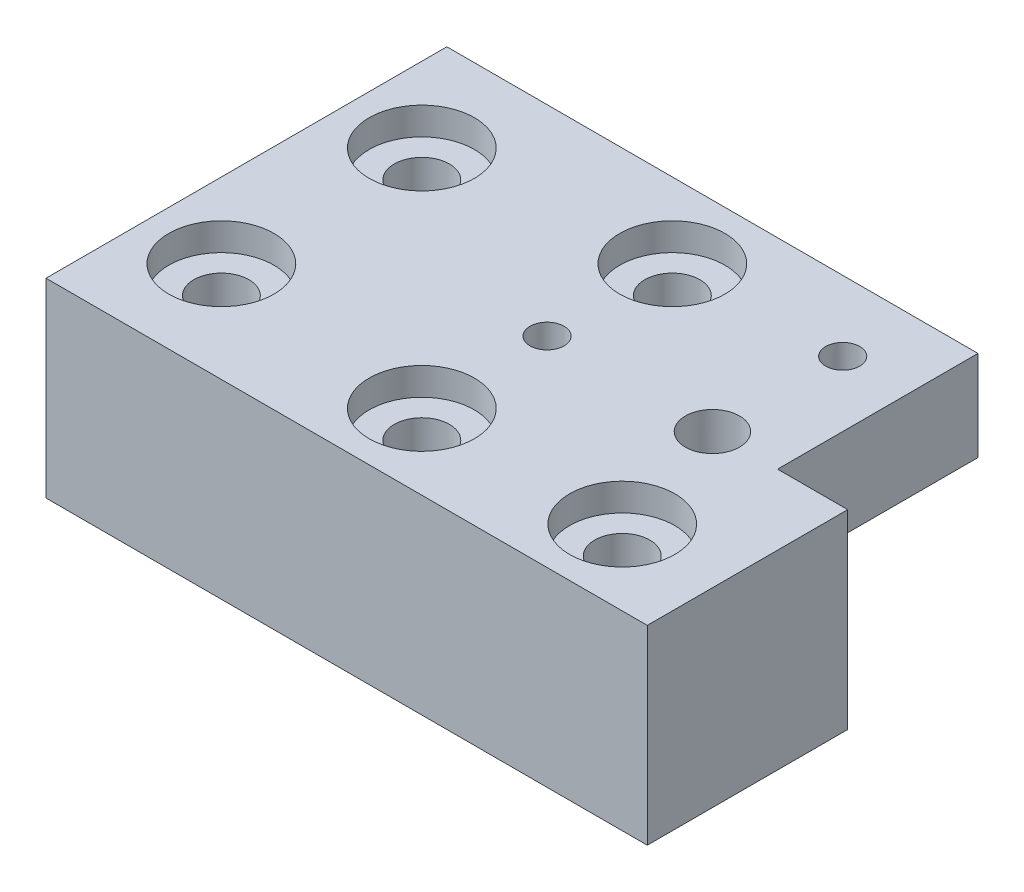
ISO-10303-21;
HEADER;
FILE_DESCRIPTION(('STEP AP214'),'2;1');
FILE_NAME('part.step','',(''),(''),'','','');
FILE_SCHEMA(('AUTOMOTIVE_DESIGN { 1 0 10303 214 1 1 1 1 }'));
ENDSEC;
DATA;
#1=APPLICATION_CONTEXT('core data for automotive mechanical design processes');
#2=APPLICATION_PROTOCOL_DEFINITION('international standard','automotive_design',2000,#1);
#3=PRODUCT_CONTEXT('',#1,'mechanical');
#4=PRODUCT('Part','Part','',(#3));
#5=PRODUCT_RELATED_PRODUCT_CATEGORY('part','',(#4));
#6=PRODUCT_DEFINITION_FORMATION('','',#4);
#7=PRODUCT_DEFINITION_CONTEXT('part definition',#1,'design');
#8=PRODUCT_DEFINITION('design','',#6,#7);
#9=PRODUCT_DEFINITION_SHAPE('','',#8);
#10=(LENGTH_UNIT() NAMED_UNIT(*) SI_UNIT(.MILLI.,.METRE.));
#11=(NAMED_UNIT(*) PLANE_ANGLE_UNIT() SI_UNIT($,.RADIAN.));
#12=(NAMED_UNIT(*) SI_UNIT($,.STERADIAN.) SOLID_ANGLE_UNIT());
#13=UNCERTAINTY_MEASURE_WITH_UNIT(LENGTH_MEASURE(1.E-05),#10,'distance_accuracy_value','');
#14=(GEOMETRIC_REPRESENTATION_CONTEXT(3) GLOBAL_UNCERTAINTY_ASSIGNED_CONTEXT((#13)) GLOBAL_UNIT_ASSIGNED_CONTEXT((#10,
#11,#12)) REPRESENTATION_CONTEXT('',''));
#15=CARTESIAN_POINT('',(0.,0.,0.));
#16=DIRECTION('',(0.,0.,1.));
#17=DIRECTION('',(1.,0.,0.));
#18=AXIS2_PLACEMENT_3D('',#15,#16,#17);
#19=CARTESIAN_POINT('',(120.,10.,-20.));
#20=DIRECTION('',(0.,0.,1.));
#21=DIRECTION('',(-1.,0.,0.));
#22=AXIS2_PLACEMENT_3D('',#19,#20,#21);
#23=PLANE('',#22);
#24=DIRECTION('',(1.,0.,0.));
#25=VECTOR('',#24,1.);
#26=CARTESIAN_POINT('',(120.,10.,-20.));
#27=LINE('',#26,#25);
#28=CARTESIAN_POINT('',(109.2,10.,-20.));
#29=VERTEX_POINT('',#28);
#30=CARTESIAN_POINT('',(113.,10.,-20.));
#31=VERTEX_POINT('',#30);
#32=EDGE_CURVE('E246',#29,#31,#27,.T.);
#33=ORIENTED_EDGE('',*,*,#32,.T.);
#34=DIRECTION('',(0.,-1.,0.));
#35=VECTOR('',#34,1.);
#36=CARTESIAN_POINT('',(113.,19.,-20.));
#37=LINE('',#36,#35);
#38=CARTESIAN_POINT('',(113.,19.,-20.));
#39=VERTEX_POINT('',#38);
#40=EDGE_CURVE('E232',#39,#31,#37,.T.);
#41=ORIENTED_EDGE('',*,*,#40,.F.);
#42=DIRECTION('',(1.,0.,0.));
#43=VECTOR('',#42,1.);
#44=CARTESIAN_POINT('',(113.,19.,-20.));
#45=LINE('',#44,#43);
#46=CARTESIAN_POINT('',(120.,19.,-20.));
#47=VERTEX_POINT('',#46);
#48=EDGE_CURVE('E238',#39,#47,#45,.T.);
#49=ORIENTED_EDGE('',*,*,#48,.T.);
#50=DIRECTION('',(0.,-1.,0.));
#51=VECTOR('',#50,1.);
#52=CARTESIAN_POINT('',(120.,10.,-20.));
#53=LINE('',#52,#51);
#54=CARTESIAN_POINT('',(120.,0.,-20.));
#55=VERTEX_POINT('',#54);
#56=EDGE_CURVE('E161',#47,#55,#53,.T.);
#57=ORIENTED_EDGE('',*,*,#56,.T.);
#58=DIRECTION('',(1.,0.,0.));
#59=VECTOR('',#58,1.);
#60=CARTESIAN_POINT('',(120.,0.,-20.));
#61=LINE('',#60,#59);
#62=CARTESIAN_POINT('',(109.2,0.,-20.));
#63=VERTEX_POINT('',#62);
#64=EDGE_CURVE('E142',#63,#55,#61,.T.);
#65=ORIENTED_EDGE('',*,*,#64,.F.);
#66=DIRECTION('',(0.,-1.,0.));
#67=VECTOR('',#66,1.);
#68=CARTESIAN_POINT('',(109.2,0.,-20.));
#69=LINE('',#68,#67);
#70=EDGE_CURVE('E150',#29,#63,#69,.T.);
#71=ORIENTED_EDGE('',*,*,#70,.F.);
#72=EDGE_LOOP('',(#33,#41,#49,#57,#65,#71));
#73=FACE_BOUND('',#72,.T.);
#74=ADVANCED_FACE('F43',(#73),#23,.F.);
#75=CARTESIAN_POINT('',(120.,10.,0.));
#76=DIRECTION('',(-1.,0.,0.));
#77=DIRECTION('',(0.,0.,-1.));
#78=AXIS2_PLACEMENT_3D('',#75,#76,#77);
#79=PLANE('',#78);
#80=DIRECTION('',(0.,0.,1.));
#81=VECTOR('',#80,1.);
#82=CARTESIAN_POINT('',(120.,0.,0.));
#83=LINE('',#82,#81);
#84=CARTESIAN_POINT('',(120.,0.,0.));
#85=VERTEX_POINT('',#84);
#86=EDGE_CURVE('E201',#55,#85,#83,.T.);
#87=ORIENTED_EDGE('',*,*,#86,.F.);
#88=ORIENTED_EDGE('',*,*,#56,.F.);
#89=DIRECTION('',(0.,0.,1.));
#90=VECTOR('',#89,1.);
#91=CARTESIAN_POINT('',(120.,19.,-20.));
#92=LINE('',#91,#90);
#93=CARTESIAN_POINT('',(120.,19.,0.));
#94=VERTEX_POINT('',#93);
#95=EDGE_CURVE('E226',#47,#94,#92,.T.);
#96=ORIENTED_EDGE('',*,*,#95,.T.);
#97=DIRECTION('',(0.,-1.,0.));
#98=VECTOR('',#97,1.);
#99=CARTESIAN_POINT('',(120.,10.,0.));
#100=LINE('',#99,#98);
#101=EDGE_CURVE('E11',#94,#85,#100,.T.);
#102=ORIENTED_EDGE('',*,*,#101,.T.);
#103=EDGE_LOOP('',(#87,#88,#96,#102));
#104=FACE_BOUND('',#103,.T.);
#105=ADVANCED_FACE('F45',(#104),#79,.F.);
#106=CARTESIAN_POINT('',(120.,10.,0.));
#107=DIRECTION('',(0.,0.,-1.));
#108=DIRECTION('',(1.,0.,0.));
#109=AXIS2_PLACEMENT_3D('',#106,#107,#108);
#110=PLANE('',#109);
#111=DIRECTION('',(-1.,0.,0.));
#112=VECTOR('',#111,1.);
#113=CARTESIAN_POINT('',(120.,0.,0.));
#114=LINE('',#113,#112);
#115=CARTESIAN_POINT('',(60.,0.,0.));
#116=VERTEX_POINT('',#115);
#117=EDGE_CURVE('E194',#85,#116,#114,.T.);
#118=ORIENTED_EDGE('',*,*,#117,.F.);
#119=ORIENTED_EDGE('',*,*,#101,.F.);
#120=DIRECTION('',(-1.,0.,0.));
#121=VECTOR('',#120,1.);
#122=CARTESIAN_POINT('',(120.,19.,0.));
#123=LINE('',#122,#121);
#124=CARTESIAN_POINT('',(60.,19.,0.));
#125=VERTEX_POINT('',#124);
#126=EDGE_CURVE('E195',#94,#125,#123,.T.);
#127=ORIENTED_EDGE('',*,*,#126,.T.);
#128=DIRECTION('',(0.,-1.,0.));
#129=VECTOR('',#128,1.);
#130=CARTESIAN_POINT('',(60.,10.,0.));
#131=LINE('',#130,#129);
#132=EDGE_CURVE('E52',#125,#116,#131,.T.);
#133=ORIENTED_EDGE('',*,*,#132,.T.);
#134=EDGE_LOOP('',(#118,#119,#127,#133));
#135=FACE_BOUND('',#134,.T.);
#136=ADVANCED_FACE('F192',(#135),#110,.F.);
#137=CARTESIAN_POINT('',(60.,10.,0.));
#138=DIRECTION('',(1.,0.,0.));
#139=DIRECTION('',(0.,0.,1.));
#140=AXIS2_PLACEMENT_3D('',#137,#138,#139);
#141=PLANE('',#140);
#142=DIRECTION('',(0.,0.,-1.));
#143=VECTOR('',#142,1.);
#144=CARTESIAN_POINT('',(60.,0.,0.));
#145=LINE('',#144,#143);
#146=CARTESIAN_POINT('',(60.,0.,-40.));
#147=VERTEX_POINT('',#146);
#148=EDGE_CURVE('E200',#116,#147,#145,.T.);
#149=ORIENTED_EDGE('',*,*,#148,.F.);
#150=ORIENTED_EDGE('',*,*,#132,.F.);
#151=DIRECTION('',(0.,0.,-1.));
#152=VECTOR('',#151,1.);
#153=CARTESIAN_POINT('',(60.,19.,0.));
#154=LINE('',#153,#152);
#155=CARTESIAN_POINT('',(60.,19.,-40.));
#156=VERTEX_POINT('',#155);
#157=EDGE_CURVE('E216',#125,#156,#154,.T.);
#158=ORIENTED_EDGE('',*,*,#157,.T.);
#159=DIRECTION('',(0.,-1.,0.));
#160=VECTOR('',#159,1.);
#161=CARTESIAN_POINT('',(60.,10.,-40.));
#162=LINE('',#161,#160);
#163=EDGE_CURVE('E184',#156,#147,#162,.T.);
#164=ORIENTED_EDGE('',*,*,#163,.T.);
#165=EDGE_LOOP('',(#149,#150,#158,#164));
#166=FACE_BOUND('',#165,.T.);
#167=ADVANCED_FACE('F215',(#166),#141,.F.);
#168=CARTESIAN_POINT('',(100.,10.,-40.));
#169=DIRECTION('',(0.,0.,1.));
#170=DIRECTION('',(-1.,0.,0.));
#171=AXIS2_PLACEMENT_3D('',#168,#169,#170);
#172=PLANE('',#171);
#173=DIRECTION('',(1.,0.,0.));
#174=VECTOR('',#173,1.);
#175=CARTESIAN_POINT('',(100.,0.,-40.));
#176=LINE('',#175,#174);
#177=CARTESIAN_POINT('',(100.,0.,-40.));
#178=VERTEX_POINT('',#177);
#179=EDGE_CURVE('E169',#147,#178,#176,.T.);
#180=ORIENTED_EDGE('',*,*,#179,.F.);
#181=ORIENTED_EDGE('',*,*,#163,.F.);
#182=DIRECTION('',(1.,0.,0.));
#183=VECTOR('',#182,1.);
#184=CARTESIAN_POINT('',(60.,19.,-40.));
#185=LINE('',#184,#183);
#186=CARTESIAN_POINT('',(113.,19.,-40.));
#187=VERTEX_POINT('',#186);
#188=EDGE_CURVE('E219',#156,#187,#185,.T.);
#189=ORIENTED_EDGE('',*,*,#188,.T.);
#190=DIRECTION('',(0.,-1.,0.));
#191=VECTOR('',#190,1.);
#192=CARTESIAN_POINT('',(113.,19.,-40.));
#193=LINE('',#192,#191);
#194=CARTESIAN_POINT('',(113.,10.,-40.));
#195=VERTEX_POINT('',#194);
#196=EDGE_CURVE('E205',#187,#195,#193,.T.);
#197=ORIENTED_EDGE('',*,*,#196,.T.);
#198=DIRECTION('',(1.,0.,0.));
#199=VECTOR('',#198,1.);
#200=CARTESIAN_POINT('',(100.,10.,-40.));
#201=LINE('',#200,#199);
#202=CARTESIAN_POINT('',(100.,10.,-40.));
#203=VERTEX_POINT('',#202);
#204=EDGE_CURVE('E233',#203,#195,#201,.T.);
#205=ORIENTED_EDGE('',*,*,#204,.F.);
#206=DIRECTION('',(0.,-1.,0.));
#207=VECTOR('',#206,1.);
#208=CARTESIAN_POINT('',(100.,10.,-40.));
#209=LINE('',#208,#207);
#210=EDGE_CURVE('E180',#203,#178,#209,.T.);
#211=ORIENTED_EDGE('',*,*,#210,.T.);
#212=EDGE_LOOP('',(#180,#181,#189,#197,#205,#211));
#213=FACE_BOUND('',#212,.T.);
#214=ADVANCED_FACE('F211',(#213),#172,.F.);
#215=CARTESIAN_POINT('',(100.,10.,-20.));
#216=DIRECTION('',(-1.,0.,0.));
#217=DIRECTION('',(0.,0.,-1.));
#218=AXIS2_PLACEMENT_3D('',#215,#216,#217);
#219=PLANE('',#218);
#220=DIRECTION('',(0.,0.,1.));
#221=VECTOR('',#220,1.);
#222=CARTESIAN_POINT('',(100.,0.,-20.));
#223=LINE('',#222,#221);
#224=CARTESIAN_POINT('',(100.,0.,-20.));
#225=VERTEX_POINT('',#224);
#226=EDGE_CURVE('E163',#178,#225,#223,.T.);
#227=ORIENTED_EDGE('',*,*,#226,.F.);
#228=ORIENTED_EDGE('',*,*,#210,.F.);
#229=DIRECTION('',(0.,0.,1.));
#230=VECTOR('',#229,1.);
#231=CARTESIAN_POINT('',(100.,10.,-20.));
#232=LINE('',#231,#230);
#233=CARTESIAN_POINT('',(100.,10.,-20.));
#234=VERTEX_POINT('',#233);
#235=EDGE_CURVE('E167',#203,#234,#232,.T.);
#236=ORIENTED_EDGE('',*,*,#235,.T.);
#237=DIRECTION('',(0.,-1.,0.));
#238=VECTOR('',#237,1.);
#239=CARTESIAN_POINT('',(100.,10.,-20.));
#240=LINE('',#239,#238);
#241=EDGE_CURVE('E175',#234,#225,#240,.T.);
#242=ORIENTED_EDGE('',*,*,#241,.T.);
#243=EDGE_LOOP('',(#227,#228,#236,#242));
#244=FACE_BOUND('',#243,.T.);
#245=ADVANCED_FACE('F375',(#244),#219,.F.);
#246=CARTESIAN_POINT('',(103.8,0.,-20.));
#247=VERTEX_POINT('',#246);
#248=EDGE_CURVE('E145',#225,#247,#61,.T.);
#249=ORIENTED_EDGE('',*,*,#248,.F.);
#250=ORIENTED_EDGE('',*,*,#241,.F.);
#251=CARTESIAN_POINT('',(103.8,10.,-20.));
#252=VERTEX_POINT('',#251);
#253=EDGE_CURVE('E176',#234,#252,#27,.T.);
#254=ORIENTED_EDGE('',*,*,#253,.T.);
#255=DIRECTION('',(0.,-1.,0.));
#256=VECTOR('',#255,1.);
#257=CARTESIAN_POINT('',(103.8,0.,-20.));
#258=LINE('',#257,#256);
#259=EDGE_CURVE('E157',#247,#252,#258,.F.);
#260=ORIENTED_EDGE('',*,*,#259,.F.);
#261=EDGE_LOOP('',(#249,#250,#254,#260));
#262=FACE_BOUND('',#261,.T.);
#263=ADVANCED_FACE('F376',(#262),#23,.F.);
#264=CARTESIAN_POINT('',(120.,0.,0.));
#265=DIRECTION('',(0.,-1.,0.));
#266=DIRECTION('',(0.,0.,-1.));
#267=AXIS2_PLACEMENT_3D('',#264,#265,#266);
#268=PLANE('',#267);
#269=CARTESIAN_POINT('',(106.5,0.,-20.));
#270=DIRECTION('',(0.,1.,0.));
#271=DIRECTION('',(0.,0.,-1.));
#272=AXIS2_PLACEMENT_3D('',#269,#270,#271);
#273=CIRCLE('',#272,2.7);
#274=EDGE_CURVE('E62',#247,#63,#273,.T.);
#275=ORIENTED_EDGE('',*,*,#274,.T.);
#276=ORIENTED_EDGE('',*,*,#64,.T.);
#277=ORIENTED_EDGE('',*,*,#86,.T.);
#278=ORIENTED_EDGE('',*,*,#117,.T.);
#279=ORIENTED_EDGE('',*,*,#148,.T.);
#280=ORIENTED_EDGE('',*,*,#179,.T.);
#281=ORIENTED_EDGE('',*,*,#226,.T.);
#282=ORIENTED_EDGE('',*,*,#248,.T.);
#283=EDGE_LOOP('',(#275,#276,#277,#278,#279,#280,#281,#282));
#284=FACE_BOUND('',#283,.T.);
#285=CARTESIAN_POINT('',(90.,0.,-20.));
#286=DIRECTION('',(0.,1.,0.));
#287=DIRECTION('',(0.,0.,-1.));
#288=AXIS2_PLACEMENT_3D('',#285,#286,#287);
#289=CIRCLE('',#288,3.35);
#290=CARTESIAN_POINT('',(90.,0.,-23.35));
#291=VERTEX_POINT('',#290);
#292=EDGE_CURVE('E276',#291,#291,#289,.T.);
#293=ORIENTED_EDGE('',*,*,#292,.T.);
#294=EDGE_LOOP('',(#293));
#295=FACE_BOUND('',#294,.T.);
#296=CARTESIAN_POINT('',(67.5,0.,-30.));
#297=DIRECTION('',(0.,-1.,0.));
#298=DIRECTION('',(0.,0.,1.));
#299=AXIS2_PLACEMENT_3D('',#296,#297,#298);
#300=CIRCLE('',#299,2.75);
#301=CARTESIAN_POINT('',(67.5,0.,-27.25));
#302=VERTEX_POINT('',#301);
#303=EDGE_CURVE('E302',#302,#302,#300,.T.);
#304=ORIENTED_EDGE('',*,*,#303,.F.);
#305=EDGE_LOOP('',(#304));
#306=FACE_BOUND('',#305,.T.);
#307=CARTESIAN_POINT('',(67.5,0.,-10.));
#308=DIRECTION('',(0.,-1.,0.));
#309=DIRECTION('',(0.,0.,1.));
#310=AXIS2_PLACEMENT_3D('',#307,#308,#309);
#311=CIRCLE('',#310,2.75);
#312=CARTESIAN_POINT('',(67.5,0.,-7.25));
#313=VERTEX_POINT('',#312);
#314=EDGE_CURVE('E317',#313,#313,#311,.T.);
#315=ORIENTED_EDGE('',*,*,#314,.F.);
#316=EDGE_LOOP('',(#315));
#317=FACE_BOUND('',#316,.T.);
#318=CARTESIAN_POINT('',(110.,0.,-7.5));
#319=DIRECTION('',(0.,-1.,0.));
#320=DIRECTION('',(0.,0.,1.));
#321=AXIS2_PLACEMENT_3D('',#318,#319,#320);
#322=CIRCLE('',#321,2.74999999999999);
#323=CARTESIAN_POINT('',(110.,0.,-4.75000000000001));
#324=VERTEX_POINT('',#323);
#325=EDGE_CURVE('E332',#324,#324,#322,.T.);
#326=ORIENTED_EDGE('',*,*,#325,.F.);
#327=EDGE_LOOP('',(#326));
#328=FACE_BOUND('',#327,.T.);
#329=CARTESIAN_POINT('',(90.,0.,-7.5));
#330=DIRECTION('',(0.,-1.,0.));
#331=DIRECTION('',(0.,0.,1.));
#332=AXIS2_PLACEMENT_3D('',#329,#330,#331);
#333=CIRCLE('',#332,2.74999999999999);
#334=CARTESIAN_POINT('',(90.,0.,-4.75000000000001));
#335=VERTEX_POINT('',#334);
#336=EDGE_CURVE('E348',#335,#335,#333,.T.);
#337=ORIENTED_EDGE('',*,*,#336,.F.);
#338=EDGE_LOOP('',(#337));
#339=FACE_BOUND('',#338,.T.);
#340=CARTESIAN_POINT('',(90.,0.,-32.5));
#341=DIRECTION('',(0.,-1.,0.));
#342=DIRECTION('',(0.,0.,1.));
#343=AXIS2_PLACEMENT_3D('',#340,#341,#342);
#344=CIRCLE('',#343,2.74999999999999);
#345=CARTESIAN_POINT('',(90.,0.,-29.75));
#346=VERTEX_POINT('',#345);
#347=EDGE_CURVE('E235',#346,#346,#344,.T.);
#348=ORIENTED_EDGE('',*,*,#347,.F.);
#349=EDGE_LOOP('',(#348));
#350=FACE_BOUND('',#349,.T.);
#351=ADVANCED_FACE('F138',(#284,#295,#306,#317,#328,#339,#350),#268,.T.);
#352=CARTESIAN_POINT('',(120.,10.,0.));
#353=DIRECTION('',(0.,1.,0.));
#354=DIRECTION('',(0.,0.,1.));
#355=AXIS2_PLACEMENT_3D('',#352,#353,#354);
#356=PLANE('',#355);
#357=CARTESIAN_POINT('',(106.5,10.,-33.));
#358=DIRECTION('',(0.,1.,0.));
#359=DIRECTION('',(0.,0.,-1.));
#360=AXIS2_PLACEMENT_3D('',#357,#358,#359);
#361=CIRCLE('',#360,3.35);
#362=CARTESIAN_POINT('',(106.5,10.,-36.35));
#363=VERTEX_POINT('',#362);
#364=EDGE_CURVE('E156',#363,#363,#361,.T.);
#365=ORIENTED_EDGE('',*,*,#364,.T.);
#366=EDGE_LOOP('',(#365));
#367=FACE_BOUND('',#366,.T.);
#368=ORIENTED_EDGE('',*,*,#253,.F.);
#369=ORIENTED_EDGE('',*,*,#235,.F.);
#370=ORIENTED_EDGE('',*,*,#204,.T.);
#371=DIRECTION('',(0.,0.,1.));
#372=VECTOR('',#371,1.);
#373=CARTESIAN_POINT('',(113.,10.,-40.));
#374=LINE('',#373,#372);
#375=EDGE_CURVE('E73',#195,#31,#374,.T.);
#376=ORIENTED_EDGE('',*,*,#375,.T.);
#377=ORIENTED_EDGE('',*,*,#32,.F.);
#378=CARTESIAN_POINT('',(106.5,10.,-20.));
#379=DIRECTION('',(0.,-1.,0.));
#380=DIRECTION('',(0.,0.,1.));
#381=AXIS2_PLACEMENT_3D('',#378,#379,#380);
#382=CIRCLE('',#381,2.7);
#383=EDGE_CURVE('E152',#252,#29,#382,.T.);
#384=ORIENTED_EDGE('',*,*,#383,.F.);
#385=EDGE_LOOP('',(#368,#369,#370,#376,#377,#384));
#386=FACE_BOUND('',#385,.T.);
#387=ADVANCED_FACE('F255',(#367,#386),#356,.F.);
#388=CARTESIAN_POINT('',(113.,19.,-40.));
#389=DIRECTION('',(-1.,0.,0.));
#390=DIRECTION('',(0.,0.,-1.));
#391=AXIS2_PLACEMENT_3D('',#388,#389,#390);
#392=PLANE('',#391);
#393=ORIENTED_EDGE('',*,*,#375,.F.);
#394=ORIENTED_EDGE('',*,*,#196,.F.);
#395=DIRECTION('',(0.,0.,1.));
#396=VECTOR('',#395,1.);
#397=CARTESIAN_POINT('',(113.,19.,-40.));
#398=LINE('',#397,#396);
#399=EDGE_CURVE('E223',#187,#39,#398,.T.);
#400=ORIENTED_EDGE('',*,*,#399,.T.);
#401=ORIENTED_EDGE('',*,*,#40,.T.);
#402=EDGE_LOOP('',(#393,#394,#400,#401));
#403=FACE_BOUND('',#402,.T.);
#404=ADVANCED_FACE('F373',(#403),#392,.F.);
#405=CARTESIAN_POINT('',(120.,19.,0.));
#406=DIRECTION('',(0.,1.,0.));
#407=DIRECTION('',(0.,0.,1.));
#408=AXIS2_PLACEMENT_3D('',#405,#406,#407);
#409=PLANE('',#408);
#410=CARTESIAN_POINT('',(106.5,19.,-20.));
#411=DIRECTION('',(0.,1.,0.));
#412=DIRECTION('',(0.,0.,-1.));
#413=AXIS2_PLACEMENT_3D('',#410,#411,#412);
#414=CIRCLE('',#413,2.7);
#415=CARTESIAN_POINT('',(106.5,19.,-22.7));
#416=VERTEX_POINT('',#415);
#417=EDGE_CURVE('E147',#416,#416,#414,.T.);
#418=ORIENTED_EDGE('',*,*,#417,.F.);
#419=EDGE_LOOP('',(#418));
#420=FACE_BOUND('',#419,.T.);
#421=CARTESIAN_POINT('',(106.5,19.,-33.));
#422=DIRECTION('',(0.,1.,0.));
#423=DIRECTION('',(0.,0.,-1.));
#424=AXIS2_PLACEMENT_3D('',#421,#422,#423);
#425=CIRCLE('',#424,1.7);
#426=CARTESIAN_POINT('',(106.5,19.,-34.7));
#427=VERTEX_POINT('',#426);
#428=EDGE_CURVE('E272',#427,#427,#425,.T.);
#429=ORIENTED_EDGE('',*,*,#428,.F.);
#430=EDGE_LOOP('',(#429));
#431=FACE_BOUND('',#430,.T.);
#432=CARTESIAN_POINT('',(90.,19.,-20.));
#433=DIRECTION('',(0.,1.,0.));
#434=DIRECTION('',(0.,0.,-1.));
#435=AXIS2_PLACEMENT_3D('',#432,#433,#434);
#436=CIRCLE('',#435,1.7);
#437=CARTESIAN_POINT('',(90.,19.,-21.7));
#438=VERTEX_POINT('',#437);
#439=EDGE_CURVE('E287',#438,#438,#436,.T.);
#440=ORIENTED_EDGE('',*,*,#439,.F.);
#441=EDGE_LOOP('',(#440));
#442=FACE_BOUND('',#441,.T.);
#443=CARTESIAN_POINT('',(67.5,19.,-30.));
#444=DIRECTION('',(0.,-1.,0.));
#445=DIRECTION('',(0.,0.,1.));
#446=AXIS2_PLACEMENT_3D('',#443,#444,#445);
#447=CIRCLE('',#446,5.24999999999999);
#448=CARTESIAN_POINT('',(67.5,19.,-24.75));
#449=VERTEX_POINT('',#448);
#450=EDGE_CURVE('E291',#449,#449,#447,.T.);
#451=ORIENTED_EDGE('',*,*,#450,.T.);
#452=EDGE_LOOP('',(#451));
#453=FACE_BOUND('',#452,.T.);
#454=CARTESIAN_POINT('',(67.5,19.,-10.));
#455=DIRECTION('',(0.,-1.,0.));
#456=DIRECTION('',(0.,0.,1.));
#457=AXIS2_PLACEMENT_3D('',#454,#455,#456);
#458=CIRCLE('',#457,5.24999999999999);
#459=CARTESIAN_POINT('',(67.5,19.,-4.75000000000001));
#460=VERTEX_POINT('',#459);
#461=EDGE_CURVE('E306',#460,#460,#458,.T.);
#462=ORIENTED_EDGE('',*,*,#461,.T.);
#463=EDGE_LOOP('',(#462));
#464=FACE_BOUND('',#463,.T.);
#465=CARTESIAN_POINT('',(110.,19.,-7.5));
#466=DIRECTION('',(0.,-1.,0.));
#467=DIRECTION('',(0.,0.,1.));
#468=AXIS2_PLACEMENT_3D('',#465,#466,#467);
#469=CIRCLE('',#468,5.25);
#470=CARTESIAN_POINT('',(110.,19.,-2.25));
#471=VERTEX_POINT('',#470);
#472=EDGE_CURVE('E320',#471,#471,#469,.T.);
#473=ORIENTED_EDGE('',*,*,#472,.T.);
#474=EDGE_LOOP('',(#473));
#475=FACE_BOUND('',#474,.T.);
#476=CARTESIAN_POINT('',(90.,19.,-7.5));
#477=DIRECTION('',(0.,-1.,0.));
#478=DIRECTION('',(0.,0.,1.));
#479=AXIS2_PLACEMENT_3D('',#476,#477,#478);
#480=CIRCLE('',#479,5.25);
#481=CARTESIAN_POINT('',(90.,19.,-2.25));
#482=VERTEX_POINT('',#481);
#483=EDGE_CURVE('E336',#482,#482,#480,.T.);
#484=ORIENTED_EDGE('',*,*,#483,.T.);
#485=EDGE_LOOP('',(#484));
#486=FACE_BOUND('',#485,.T.);
#487=CARTESIAN_POINT('',(90.,19.,-32.5));
#488=DIRECTION('',(0.,-1.,0.));
#489=DIRECTION('',(0.,0.,1.));
#490=AXIS2_PLACEMENT_3D('',#487,#488,#489);
#491=CIRCLE('',#490,5.25);
#492=CARTESIAN_POINT('',(90.,19.,-27.25));
#493=VERTEX_POINT('',#492);
#494=EDGE_CURVE('E351',#493,#493,#491,.T.);
#495=ORIENTED_EDGE('',*,*,#494,.T.);
#496=EDGE_LOOP('',(#495));
#497=FACE_BOUND('',#496,.T.);
#498=ORIENTED_EDGE('',*,*,#48,.F.);
#499=ORIENTED_EDGE('',*,*,#399,.F.);
#500=ORIENTED_EDGE('',*,*,#188,.F.);
#501=ORIENTED_EDGE('',*,*,#157,.F.);
#502=ORIENTED_EDGE('',*,*,#126,.F.);
#503=ORIENTED_EDGE('',*,*,#95,.F.);
#504=EDGE_LOOP('',(#498,#499,#500,#501,#502,#503));
#505=FACE_BOUND('',#504,.T.);
#506=ADVANCED_FACE('F370',(#420,#431,#442,#453,#464,#475,#486,#497,#505),#409,.T.);
#507=CARTESIAN_POINT('',(90.,19.,-32.5));
#508=DIRECTION('',(0.,1.,0.));
#509=DIRECTION('',(0.,0.,1.));
#510=AXIS2_PLACEMENT_3D('',#507,#508,#509);
#511=CYLINDRICAL_SURFACE('',#510,2.75);
#512=ORIENTED_EDGE('',*,*,#347,.T.);
#513=EDGE_LOOP('',(#512));
#514=FACE_BOUND('',#513,.T.);
#515=CARTESIAN_POINT('',(90.,16.25,-32.5));
#516=DIRECTION('',(0.,-1.,0.));
#517=DIRECTION('',(0.,0.,1.));
#518=AXIS2_PLACEMENT_3D('',#515,#516,#517);
#519=CIRCLE('',#518,2.75);
#520=CARTESIAN_POINT('',(90.,16.25,-29.75));
#521=VERTEX_POINT('',#520);
#522=EDGE_CURVE('E359',#521,#521,#519,.T.);
#523=ORIENTED_EDGE('',*,*,#522,.F.);
#524=EDGE_LOOP('',(#523));
#525=FACE_BOUND('',#524,.T.);
#526=ADVANCED_FACE('F445',(#514,#525),#511,.F.);
#527=CARTESIAN_POINT('',(87.25,16.25,-32.5));
#528=DIRECTION('',(0.,-1.,0.));
#529=DIRECTION('',(0.,0.,-1.));
#530=AXIS2_PLACEMENT_3D('',#527,#528,#529);
#531=PLANE('',#530);
#532=ORIENTED_EDGE('',*,*,#522,.T.);
#533=EDGE_LOOP('',(#532));
#534=FACE_BOUND('',#533,.T.);
#535=CARTESIAN_POINT('',(90.,16.25,-32.5));
#536=DIRECTION('',(0.,-1.,0.));
#537=DIRECTION('',(0.,0.,1.));
#538=AXIS2_PLACEMENT_3D('',#535,#536,#537);
#539=CIRCLE('',#538,5.25);
#540=CARTESIAN_POINT('',(90.,16.25,-27.25));
#541=VERTEX_POINT('',#540);
#542=EDGE_CURVE('E355',#541,#541,#539,.T.);
#543=ORIENTED_EDGE('',*,*,#542,.F.);
#544=EDGE_LOOP('',(#543));
#545=FACE_BOUND('',#544,.T.);
#546=ADVANCED_FACE('F454',(#534,#545),#531,.F.);
#547=CARTESIAN_POINT('',(90.,19.,-32.5));
#548=DIRECTION('',(0.,1.,0.));
#549=DIRECTION('',(0.,0.,1.));
#550=AXIS2_PLACEMENT_3D('',#547,#548,#549);
#551=CYLINDRICAL_SURFACE('',#550,5.25);
#552=ORIENTED_EDGE('',*,*,#542,.T.);
#553=EDGE_LOOP('',(#552));
#554=FACE_BOUND('',#553,.T.);
#555=ORIENTED_EDGE('',*,*,#494,.F.);
#556=EDGE_LOOP('',(#555));
#557=FACE_BOUND('',#556,.T.);
#558=ADVANCED_FACE('F464',(#554,#557),#551,.F.);
#559=CARTESIAN_POINT('',(90.,19.,-7.5));
#560=DIRECTION('',(0.,1.,0.));
#561=DIRECTION('',(0.,0.,1.));
#562=AXIS2_PLACEMENT_3D('',#559,#560,#561);
#563=CYLINDRICAL_SURFACE('',#562,2.75);
#564=ORIENTED_EDGE('',*,*,#336,.T.);
#565=EDGE_LOOP('',(#564));
#566=FACE_BOUND('',#565,.T.);
#567=CARTESIAN_POINT('',(90.,16.25,-7.5));
#568=DIRECTION('',(0.,-1.,0.));
#569=DIRECTION('',(0.,0.,1.));
#570=AXIS2_PLACEMENT_3D('',#567,#568,#569);
#571=CIRCLE('',#570,2.75);
#572=CARTESIAN_POINT('',(90.,16.25,-4.75));
#573=VERTEX_POINT('',#572);
#574=EDGE_CURVE('E344',#573,#573,#571,.T.);
#575=ORIENTED_EDGE('',*,*,#574,.F.);
#576=EDGE_LOOP('',(#575));
#577=FACE_BOUND('',#576,.T.);
#578=ADVANCED_FACE('F474',(#566,#577),#563,.F.);
#579=CARTESIAN_POINT('',(87.25,16.25,-7.5));
#580=DIRECTION('',(0.,-1.,0.));
#581=DIRECTION('',(0.,0.,-1.));
#582=AXIS2_PLACEMENT_3D('',#579,#580,#581);
#583=PLANE('',#582);
#584=ORIENTED_EDGE('',*,*,#574,.T.);
#585=EDGE_LOOP('',(#584));
#586=FACE_BOUND('',#585,.T.);
#587=CARTESIAN_POINT('',(90.,16.25,-7.5));
#588=DIRECTION('',(0.,-1.,0.));
#589=DIRECTION('',(0.,0.,1.));
#590=AXIS2_PLACEMENT_3D('',#587,#588,#589);
#591=CIRCLE('',#590,5.25);
#592=CARTESIAN_POINT('',(90.,16.25,-2.25));
#593=VERTEX_POINT('',#592);
#594=EDGE_CURVE('E340',#593,#593,#591,.T.);
#595=ORIENTED_EDGE('',*,*,#594,.F.);
#596=EDGE_LOOP('',(#595));
#597=FACE_BOUND('',#596,.T.);
#598=ADVANCED_FACE('F484',(#586,#597),#583,.F.);
#599=CARTESIAN_POINT('',(90.,19.,-7.5));
#600=DIRECTION('',(0.,1.,0.));
#601=DIRECTION('',(0.,0.,1.));
#602=AXIS2_PLACEMENT_3D('',#599,#600,#601);
#603=CYLINDRICAL_SURFACE('',#602,5.25);
#604=ORIENTED_EDGE('',*,*,#594,.T.);
#605=EDGE_LOOP('',(#604));
#606=FACE_BOUND('',#605,.T.);
#607=ORIENTED_EDGE('',*,*,#483,.F.);
#608=EDGE_LOOP('',(#607));
#609=FACE_BOUND('',#608,.T.);
#610=ADVANCED_FACE('F494',(#606,#609),#603,.F.);
#611=CARTESIAN_POINT('',(110.,19.,-7.5));
#612=DIRECTION('',(0.,1.,0.));
#613=DIRECTION('',(0.,0.,1.));
#614=AXIS2_PLACEMENT_3D('',#611,#612,#613);
#615=CYLINDRICAL_SURFACE('',#614,2.75);
#616=ORIENTED_EDGE('',*,*,#325,.T.);
#617=EDGE_LOOP('',(#616));
#618=FACE_BOUND('',#617,.T.);
#619=CARTESIAN_POINT('',(110.,16.25,-7.5));
#620=DIRECTION('',(0.,-1.,0.));
#621=DIRECTION('',(0.,0.,1.));
#622=AXIS2_PLACEMENT_3D('',#619,#620,#621);
#623=CIRCLE('',#622,2.75);
#624=CARTESIAN_POINT('',(110.,16.25,-4.75));
#625=VERTEX_POINT('',#624);
#626=EDGE_CURVE('E328',#625,#625,#623,.T.);
#627=ORIENTED_EDGE('',*,*,#626,.F.);
#628=EDGE_LOOP('',(#627));
#629=FACE_BOUND('',#628,.T.);
#630=ADVANCED_FACE('F504',(#618,#629),#615,.F.);
#631=CARTESIAN_POINT('',(107.25,16.25,-7.5));
#632=DIRECTION('',(0.,-1.,0.));
#633=DIRECTION('',(0.,0.,-1.));
#634=AXIS2_PLACEMENT_3D('',#631,#632,#633);
#635=PLANE('',#634);
#636=ORIENTED_EDGE('',*,*,#626,.T.);
#637=EDGE_LOOP('',(#636));
#638=FACE_BOUND('',#637,.T.);
#639=CARTESIAN_POINT('',(110.,16.25,-7.5));
#640=DIRECTION('',(0.,-1.,0.));
#641=DIRECTION('',(0.,0.,1.));
#642=AXIS2_PLACEMENT_3D('',#639,#640,#641);
#643=CIRCLE('',#642,5.25);
#644=CARTESIAN_POINT('',(110.,16.25,-2.25));
#645=VERTEX_POINT('',#644);
#646=EDGE_CURVE('E324',#645,#645,#643,.T.);
#647=ORIENTED_EDGE('',*,*,#646,.F.);
#648=EDGE_LOOP('',(#647));
#649=FACE_BOUND('',#648,.T.);
#650=ADVANCED_FACE('F514',(#638,#649),#635,.F.);
#651=CARTESIAN_POINT('',(110.,19.,-7.5));
#652=DIRECTION('',(0.,1.,0.));
#653=DIRECTION('',(0.,0.,1.));
#654=AXIS2_PLACEMENT_3D('',#651,#652,#653);
#655=CYLINDRICAL_SURFACE('',#654,5.25);
#656=ORIENTED_EDGE('',*,*,#646,.T.);
#657=EDGE_LOOP('',(#656));
#658=FACE_BOUND('',#657,.T.);
#659=ORIENTED_EDGE('',*,*,#472,.F.);
#660=EDGE_LOOP('',(#659));
#661=FACE_BOUND('',#660,.T.);
#662=ADVANCED_FACE('F524',(#658,#661),#655,.F.);
#663=CARTESIAN_POINT('',(67.5,19.,-10.));
#664=DIRECTION('',(0.,1.,0.));
#665=DIRECTION('',(0.,0.,1.));
#666=AXIS2_PLACEMENT_3D('',#663,#664,#665);
#667=CYLINDRICAL_SURFACE('',#666,2.75);
#668=ORIENTED_EDGE('',*,*,#314,.T.);
#669=EDGE_LOOP('',(#668));
#670=FACE_BOUND('',#669,.T.);
#671=CARTESIAN_POINT('',(67.5,16.25,-10.));
#672=DIRECTION('',(0.,-1.,0.));
#673=DIRECTION('',(0.,0.,1.));
#674=AXIS2_PLACEMENT_3D('',#671,#672,#673);
#675=CIRCLE('',#674,2.75000000000001);
#676=CARTESIAN_POINT('',(67.5,16.25,-7.24999999999999));
#677=VERTEX_POINT('',#676);
#678=EDGE_CURVE('E314',#677,#677,#675,.T.);
#679=ORIENTED_EDGE('',*,*,#678,.F.);
#680=EDGE_LOOP('',(#679));
#681=FACE_BOUND('',#680,.T.);
#682=ADVANCED_FACE('F534',(#670,#681),#667,.F.);
#683=CARTESIAN_POINT('',(64.75,16.25,-10.));
#684=DIRECTION('',(0.,-1.,0.));
#685=DIRECTION('',(0.,0.,-1.));
#686=AXIS2_PLACEMENT_3D('',#683,#684,#685);
#687=PLANE('',#686);
#688=ORIENTED_EDGE('',*,*,#678,.T.);
#689=EDGE_LOOP('',(#688));
#690=FACE_BOUND('',#689,.T.);
#691=CARTESIAN_POINT('',(67.5,16.25,-10.));
#692=DIRECTION('',(0.,-1.,0.));
#693=DIRECTION('',(0.,0.,1.));
#694=AXIS2_PLACEMENT_3D('',#691,#692,#693);
#695=CIRCLE('',#694,5.24999999999999);
#696=CARTESIAN_POINT('',(67.5,16.25,-4.75000000000001));
#697=VERTEX_POINT('',#696);
#698=EDGE_CURVE('E310',#697,#697,#695,.T.);
#699=ORIENTED_EDGE('',*,*,#698,.F.);
#700=EDGE_LOOP('',(#699));
#701=FACE_BOUND('',#700,.T.);
#702=ADVANCED_FACE('F544',(#690,#701),#687,.F.);
#703=CARTESIAN_POINT('',(67.5,19.,-10.));
#704=DIRECTION('',(0.,1.,0.));
#705=DIRECTION('',(0.,0.,1.));
#706=AXIS2_PLACEMENT_3D('',#703,#704,#705);
#707=CYLINDRICAL_SURFACE('',#706,5.24999999999999);
#708=ORIENTED_EDGE('',*,*,#698,.T.);
#709=EDGE_LOOP('',(#708));
#710=FACE_BOUND('',#709,.T.);
#711=ORIENTED_EDGE('',*,*,#461,.F.);
#712=EDGE_LOOP('',(#711));
#713=FACE_BOUND('',#712,.T.);
#714=ADVANCED_FACE('F554',(#710,#713),#707,.F.);
#715=CARTESIAN_POINT('',(67.5,19.,-30.));
#716=DIRECTION('',(0.,1.,0.));
#717=DIRECTION('',(0.,0.,1.));
#718=AXIS2_PLACEMENT_3D('',#715,#716,#717);
#719=CYLINDRICAL_SURFACE('',#718,2.75);
#720=ORIENTED_EDGE('',*,*,#303,.T.);
#721=EDGE_LOOP('',(#720));
#722=FACE_BOUND('',#721,.T.);
#723=CARTESIAN_POINT('',(67.5,16.25,-30.));
#724=DIRECTION('',(0.,-1.,0.));
#725=DIRECTION('',(0.,0.,1.));
#726=AXIS2_PLACEMENT_3D('',#723,#724,#725);
#727=CIRCLE('',#726,2.75000000000001);
#728=CARTESIAN_POINT('',(67.5,16.25,-27.25));
#729=VERTEX_POINT('',#728);
#730=EDGE_CURVE('E298',#729,#729,#727,.T.);
#731=ORIENTED_EDGE('',*,*,#730,.F.);
#732=EDGE_LOOP('',(#731));
#733=FACE_BOUND('',#732,.T.);
#734=ADVANCED_FACE('F564',(#722,#733),#719,.F.);
#735=CARTESIAN_POINT('',(64.75,16.25,-30.));
#736=DIRECTION('',(0.,-1.,0.));
#737=DIRECTION('',(0.,0.,-1.));
#738=AXIS2_PLACEMENT_3D('',#735,#736,#737);
#739=PLANE('',#738);
#740=ORIENTED_EDGE('',*,*,#730,.T.);
#741=EDGE_LOOP('',(#740));
#742=FACE_BOUND('',#741,.T.);
#743=CARTESIAN_POINT('',(67.5,16.25,-30.));
#744=DIRECTION('',(0.,-1.,0.));
#745=DIRECTION('',(0.,0.,1.));
#746=AXIS2_PLACEMENT_3D('',#743,#744,#745);
#747=CIRCLE('',#746,5.24999999999999);
#748=CARTESIAN_POINT('',(67.5,16.25,-24.75));
#749=VERTEX_POINT('',#748);
#750=EDGE_CURVE('E294',#749,#749,#747,.T.);
#751=ORIENTED_EDGE('',*,*,#750,.F.);
#752=EDGE_LOOP('',(#751));
#753=FACE_BOUND('',#752,.T.);
#754=ADVANCED_FACE('F574',(#742,#753),#739,.F.);
#755=CARTESIAN_POINT('',(67.5,19.,-30.));
#756=DIRECTION('',(0.,1.,0.));
#757=DIRECTION('',(0.,0.,1.));
#758=AXIS2_PLACEMENT_3D('',#755,#756,#757);
#759=CYLINDRICAL_SURFACE('',#758,5.24999999999999);
#760=ORIENTED_EDGE('',*,*,#750,.T.);
#761=EDGE_LOOP('',(#760));
#762=FACE_BOUND('',#761,.T.);
#763=ORIENTED_EDGE('',*,*,#450,.F.);
#764=EDGE_LOOP('',(#763));
#765=FACE_BOUND('',#764,.T.);
#766=ADVANCED_FACE('F584',(#762,#765),#759,.F.);
#767=CARTESIAN_POINT('',(90.,0.,-20.));
#768=DIRECTION('',(0.,-1.,0.));
#769=DIRECTION('',(0.,0.,-1.));
#770=AXIS2_PLACEMENT_3D('',#767,#768,#769);
#771=CYLINDRICAL_SURFACE('',#770,1.7);
#772=ORIENTED_EDGE('',*,*,#439,.T.);
#773=EDGE_LOOP('',(#772));
#774=FACE_BOUND('',#773,.T.);
#775=CARTESIAN_POINT('',(90.,16.,-20.));
#776=DIRECTION('',(0.,1.,0.));
#777=DIRECTION('',(0.,0.,-1.));
#778=AXIS2_PLACEMENT_3D('',#775,#776,#777);
#779=CIRCLE('',#778,1.7);
#780=CARTESIAN_POINT('',(90.,16.,-21.7));
#781=VERTEX_POINT('',#780);
#782=EDGE_CURVE('E283',#781,#781,#779,.T.);
#783=ORIENTED_EDGE('',*,*,#782,.F.);
#784=EDGE_LOOP('',(#783));
#785=FACE_BOUND('',#784,.T.);
#786=ADVANCED_FACE('F594',(#774,#785),#771,.F.);
#787=CARTESIAN_POINT('',(88.3,16.,-20.));
#788=DIRECTION('',(0.,1.,0.));
#789=DIRECTION('',(0.,0.,1.));
#790=AXIS2_PLACEMENT_3D('',#787,#788,#789);
#791=PLANE('',#790);
#792=ORIENTED_EDGE('',*,*,#782,.T.);
#793=EDGE_LOOP('',(#792));
#794=FACE_BOUND('',#793,.T.);
#795=CARTESIAN_POINT('',(90.,16.,-20.));
#796=DIRECTION('',(0.,1.,0.));
#797=DIRECTION('',(0.,0.,-1.));
#798=AXIS2_PLACEMENT_3D('',#795,#796,#797);
#799=CIRCLE('',#798,3.35);
#800=CARTESIAN_POINT('',(90.,16.,-23.35));
#801=VERTEX_POINT('',#800);
#802=EDGE_CURVE('E279',#801,#801,#799,.T.);
#803=ORIENTED_EDGE('',*,*,#802,.F.);
#804=EDGE_LOOP('',(#803));
#805=FACE_BOUND('',#804,.T.);
#806=ADVANCED_FACE('F604',(#794,#805),#791,.F.);
#807=CARTESIAN_POINT('',(90.,0.,-20.));
#808=DIRECTION('',(0.,-1.,0.));
#809=DIRECTION('',(0.,0.,-1.));
#810=AXIS2_PLACEMENT_3D('',#807,#808,#809);
#811=CYLINDRICAL_SURFACE('',#810,3.35);
#812=ORIENTED_EDGE('',*,*,#802,.T.);
#813=EDGE_LOOP('',(#812));
#814=FACE_BOUND('',#813,.T.);
#815=ORIENTED_EDGE('',*,*,#292,.F.);
#816=EDGE_LOOP('',(#815));
#817=FACE_BOUND('',#816,.T.);
#818=ADVANCED_FACE('F614',(#814,#817),#811,.F.);
#819=CARTESIAN_POINT('',(106.5,10.,-33.));
#820=DIRECTION('',(0.,-1.,0.));
#821=DIRECTION('',(0.,0.,-1.));
#822=AXIS2_PLACEMENT_3D('',#819,#820,#821);
#823=CYLINDRICAL_SURFACE('',#822,1.7);
#824=ORIENTED_EDGE('',*,*,#428,.T.);
#825=EDGE_LOOP('',(#824));
#826=FACE_BOUND('',#825,.T.);
#827=CARTESIAN_POINT('',(106.5,16.,-33.));
#828=DIRECTION('',(0.,1.,0.));
#829=DIRECTION('',(0.,0.,-1.));
#830=AXIS2_PLACEMENT_3D('',#827,#828,#829);
#831=CIRCLE('',#830,1.7);
#832=CARTESIAN_POINT('',(106.5,16.,-34.7));
#833=VERTEX_POINT('',#832);
#834=EDGE_CURVE('E268',#833,#833,#831,.T.);
#835=ORIENTED_EDGE('',*,*,#834,.F.);
#836=EDGE_LOOP('',(#835));
#837=FACE_BOUND('',#836,.T.);
#838=ADVANCED_FACE('F624',(#826,#837),#823,.F.);
#839=CARTESIAN_POINT('',(104.8,16.,-33.));
#840=DIRECTION('',(0.,1.,0.));
#841=DIRECTION('',(0.,0.,1.));
#842=AXIS2_PLACEMENT_3D('',#839,#840,#841);
#843=PLANE('',#842);
#844=ORIENTED_EDGE('',*,*,#834,.T.);
#845=EDGE_LOOP('',(#844));
#846=FACE_BOUND('',#845,.T.);
#847=CARTESIAN_POINT('',(106.5,16.,-33.));
#848=DIRECTION('',(0.,1.,0.));
#849=DIRECTION('',(0.,0.,-1.));
#850=AXIS2_PLACEMENT_3D('',#847,#848,#849);
#851=CIRCLE('',#850,3.35);
#852=CARTESIAN_POINT('',(106.5,16.,-36.35));
#853=VERTEX_POINT('',#852);
#854=EDGE_CURVE('E264',#853,#853,#851,.T.);
#855=ORIENTED_EDGE('',*,*,#854,.F.);
#856=EDGE_LOOP('',(#855));
#857=FACE_BOUND('',#856,.T.);
#858=ADVANCED_FACE('F634',(#846,#857),#843,.F.);
#859=CARTESIAN_POINT('',(106.5,10.,-33.));
#860=DIRECTION('',(0.,-1.,0.));
#861=DIRECTION('',(0.,0.,-1.));
#862=AXIS2_PLACEMENT_3D('',#859,#860,#861);
#863=CYLINDRICAL_SURFACE('',#862,3.35);
#864=ORIENTED_EDGE('',*,*,#854,.T.);
#865=EDGE_LOOP('',(#864));
#866=FACE_BOUND('',#865,.T.);
#867=ORIENTED_EDGE('',*,*,#364,.F.);
#868=EDGE_LOOP('',(#867));
#869=FACE_BOUND('',#868,.T.);
#870=ADVANCED_FACE('F644',(#866,#869),#863,.F.);
#871=CARTESIAN_POINT('',(106.5,0.,-20.));
#872=DIRECTION('',(0.,-1.,0.));
#873=DIRECTION('',(0.,0.,-1.));
#874=AXIS2_PLACEMENT_3D('',#871,#872,#873);
#875=CYLINDRICAL_SURFACE('',#874,2.7);
#876=ORIENTED_EDGE('',*,*,#417,.T.);
#877=EDGE_LOOP('',(#876));
#878=FACE_BOUND('',#877,.T.);
#879=ORIENTED_EDGE('',*,*,#383,.T.);
#880=ORIENTED_EDGE('',*,*,#70,.T.);
#881=ORIENTED_EDGE('',*,*,#274,.F.);
#882=ORIENTED_EDGE('',*,*,#259,.T.);
#883=EDGE_LOOP('',(#879,#880,#881,#882));
#884=FACE_BOUND('',#883,.T.);
#885=ADVANCED_FACE('F151',(#878,#884),#875,.F.);
#886=CLOSED_SHELL('',(#74,#105,#136,#167,#214,#245,#263,#351,#387,#404,#506,#526,#546,#558,#578,
#598,#610,#630,#650,#662,#682,#702,#714,#734,#754,#766,#786,#806,#818,#838,#858,#870,#885));
#887=MANIFOLD_SOLID_BREP('B2',#886);
#888=ADVANCED_BREP_SHAPE_REPRESENTATION('',(#18,#887),#14);
#889=SHAPE_DEFINITION_REPRESENTATION(#9,#888);
ENDSEC;
END-ISO-10303-21;
